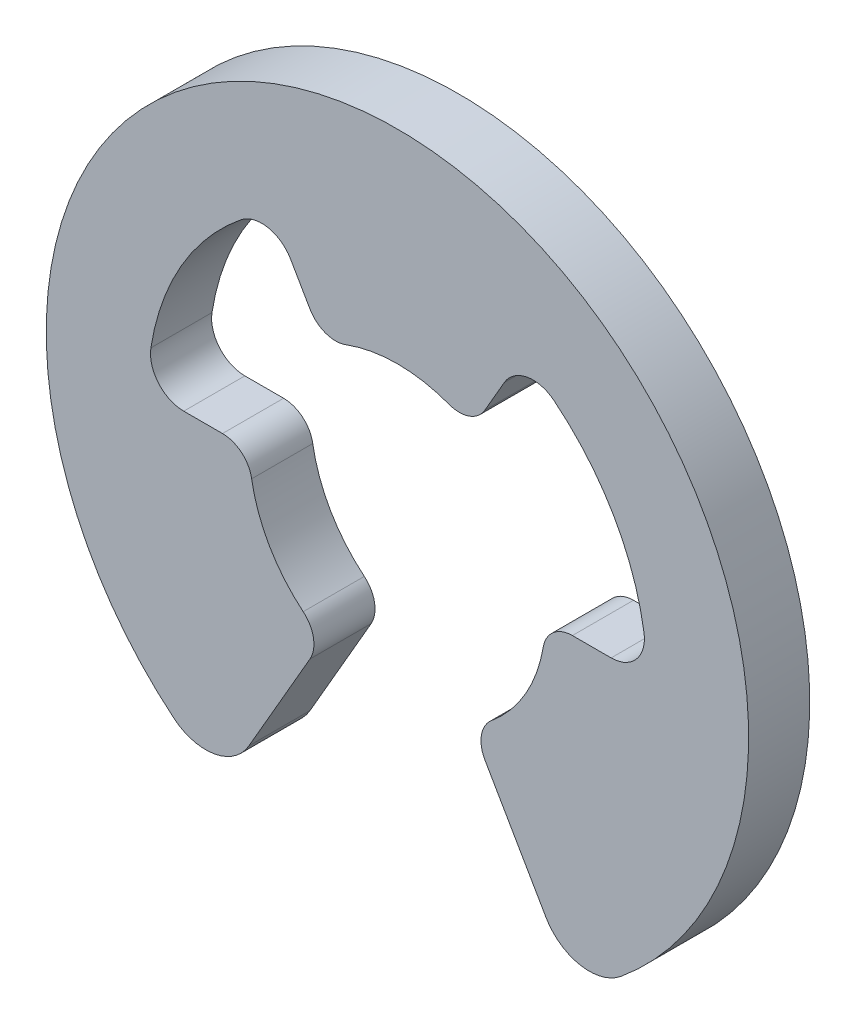
ISO-10303-21;
HEADER;
FILE_DESCRIPTION(('STEP AP214'),'2;1');
FILE_NAME('part.step','',(''),(''),'','','');
FILE_SCHEMA(('AUTOMOTIVE_DESIGN { 1 0 10303 214 1 1 1 1 }'));
ENDSEC;
DATA;
#1=APPLICATION_CONTEXT('core data for automotive mechanical design processes');
#2=APPLICATION_PROTOCOL_DEFINITION('international standard','automotive_design',2000,#1);
#3=PRODUCT_CONTEXT('',#1,'mechanical');
#4=PRODUCT('Part','Part','',(#3));
#5=PRODUCT_RELATED_PRODUCT_CATEGORY('part','',(#4));
#6=PRODUCT_DEFINITION_FORMATION('','',#4);
#7=PRODUCT_DEFINITION_CONTEXT('part definition',#1,'design');
#8=PRODUCT_DEFINITION('design','',#6,#7);
#9=PRODUCT_DEFINITION_SHAPE('','',#8);
#10=(LENGTH_UNIT() NAMED_UNIT(*) SI_UNIT(.MILLI.,.METRE.));
#11=(NAMED_UNIT(*) PLANE_ANGLE_UNIT() SI_UNIT($,.RADIAN.));
#12=(NAMED_UNIT(*) SI_UNIT($,.STERADIAN.) SOLID_ANGLE_UNIT());
#13=UNCERTAINTY_MEASURE_WITH_UNIT(LENGTH_MEASURE(1.E-05),#10,'distance_accuracy_value','');
#14=(GEOMETRIC_REPRESENTATION_CONTEXT(3) GLOBAL_UNCERTAINTY_ASSIGNED_CONTEXT((#13)) GLOBAL_UNIT_ASSIGNED_CONTEXT((#10,
#11,#12)) REPRESENTATION_CONTEXT('',''));
#15=CARTESIAN_POINT('',(0.,0.,0.));
#16=DIRECTION('',(0.,0.,1.));
#17=DIRECTION('',(1.,0.,0.));
#18=AXIS2_PLACEMENT_3D('',#15,#16,#17);
#19=CARTESIAN_POINT('',(1.5815751888149,-2.73936858301779,0.55245));
#20=DIRECTION('',(0.866025403784419,0.500000000000034,0.));
#21=DIRECTION('',(-0.500000000000034,0.866025403784419,0.));
#22=AXIS2_PLACEMENT_3D('',#19,#20,#21);
#23=PLANE('',#22);
#24=DIRECTION('',(0.500000000000034,-0.866025403784419,0.));
#25=VECTOR('',#24,1.);
#26=CARTESIAN_POINT('',(1.5815751888149,-2.73936858301779,-0.55245));
#27=LINE('',#26,#25);
#28=CARTESIAN_POINT('',(1.5815751888149,-2.73936858301779,-0.55245));
#29=VERTEX_POINT('',#28);
#30=CARTESIAN_POINT('',(2.6862076194889,-4.65264807663329,-0.55245));
#31=VERTEX_POINT('',#30);
#32=EDGE_CURVE('E11',#29,#31,#27,.T.);
#33=ORIENTED_EDGE('',*,*,#32,.T.);
#34=DIRECTION('',(0.,0.,-1.));
#35=VECTOR('',#34,1.);
#36=CARTESIAN_POINT('',(2.6862076194889,-4.65264807663329,0.55245));
#37=LINE('',#36,#35);
#38=CARTESIAN_POINT('',(2.6862076194889,-4.65264807663329,0.55245));
#39=VERTEX_POINT('',#38);
#40=EDGE_CURVE('E25',#39,#31,#37,.T.);
#41=ORIENTED_EDGE('',*,*,#40,.F.);
#42=DIRECTION('',(0.500000000000034,-0.866025403784419,0.));
#43=VECTOR('',#42,1.);
#44=CARTESIAN_POINT('',(1.5815751888149,-2.73936858301779,0.55245));
#45=LINE('',#44,#43);
#46=CARTESIAN_POINT('',(1.5815751888149,-2.73936858301779,0.55245));
#47=VERTEX_POINT('',#46);
#48=EDGE_CURVE('E352',#47,#39,#45,.T.);
#49=ORIENTED_EDGE('',*,*,#48,.F.);
#50=DIRECTION('',(0.,0.,-1.));
#51=VECTOR('',#50,1.);
#52=CARTESIAN_POINT('',(1.5815751888149,-2.73936858301779,0.55245));
#53=LINE('',#52,#51);
#54=EDGE_CURVE('E348',#47,#29,#53,.T.);
#55=ORIENTED_EDGE('',*,*,#54,.T.);
#56=EDGE_LOOP('',(#33,#41,#49,#55));
#57=FACE_BOUND('',#56,.T.);
#58=ADVANCED_FACE('F17',(#57),#23,.F.);
#59=CARTESIAN_POINT('',(2.04461299145625,-2.47203358301781,0.55245));
#60=DIRECTION('',(0.,0.,1.));
#61=DIRECTION('',(0.984186434408431,-0.177135717252107,0.));
#62=AXIS2_PLACEMENT_3D('',#59,#60,#61);
#63=CYLINDRICAL_SURFACE('',#62,0.53467);
#64=CARTESIAN_POINT('',(2.04461299145625,-2.47203358301781,-0.55245));
#65=DIRECTION('',(0.,0.,1.));
#66=DIRECTION('',(1.,0.,0.));
#67=AXIS2_PLACEMENT_3D('',#64,#65,#66);
#68=CIRCLE('',#67,0.53467);
#69=CARTESIAN_POINT('',(1.703844185326,-2.0600279645264,-0.55245));
#70=VERTEX_POINT('',#69);
#71=EDGE_CURVE('E343',#70,#29,#68,.T.);
#72=ORIENTED_EDGE('',*,*,#71,.T.);
#73=ORIENTED_EDGE('',*,*,#54,.F.);
#74=CARTESIAN_POINT('',(2.04461299145625,-2.47203358301781,0.55245));
#75=DIRECTION('',(0.,0.,1.));
#76=DIRECTION('',(1.,0.,0.));
#77=AXIS2_PLACEMENT_3D('',#74,#75,#76);
#78=CIRCLE('',#77,0.53467);
#79=CARTESIAN_POINT('',(1.703844185326,-2.0600279645264,0.55245));
#80=VERTEX_POINT('',#79);
#81=EDGE_CURVE('E338',#80,#47,#78,.T.);
#82=ORIENTED_EDGE('',*,*,#81,.F.);
#83=DIRECTION('',(0.,0.,-1.));
#84=VECTOR('',#83,1.);
#85=CARTESIAN_POINT('',(1.703844185326,-2.0600279645264,0.55245));
#86=LINE('',#85,#84);
#87=EDGE_CURVE('E334',#80,#70,#86,.T.);
#88=ORIENTED_EDGE('',*,*,#87,.T.);
#89=EDGE_LOOP('',(#72,#73,#82,#88));
#90=FACE_BOUND('',#89,.T.);
#91=ADVANCED_FACE('F365',(#90),#63,.T.);
#92=CARTESIAN_POINT('',(-3.68195057776077E-13,2.1543097167287E-13,0.55245));
#93=DIRECTION('',(0.,0.,1.));
#94=DIRECTION('',(-0.866025405955022,0.499999996240439,0.));
#95=AXIS2_PLACEMENT_3D('',#92,#93,#94);
#96=CYLINDRICAL_SURFACE('',#95,2.67335);
#97=DIRECTION('',(0.,0.,-1.));
#98=VECTOR('',#97,1.);
#99=CARTESIAN_POINT('',(2.63595864631771,-0.44555834343324,0.55245));
#100=LINE('',#99,#98);
#101=CARTESIAN_POINT('',(2.63595864631771,-0.44555834343324,0.55245));
#102=VERTEX_POINT('',#101);
#103=CARTESIAN_POINT('',(2.63595864631771,-0.44555834343324,-0.55245));
#104=VERTEX_POINT('',#103);
#105=EDGE_CURVE('E330',#102,#104,#100,.T.);
#106=ORIENTED_EDGE('',*,*,#105,.T.);
#107=CARTESIAN_POINT('',(-3.68195057776077E-13,2.1543097167287E-13,-0.55245));
#108=DIRECTION('',(0.,0.,1.));
#109=DIRECTION('',(1.,0.,0.));
#110=AXIS2_PLACEMENT_3D('',#107,#108,#109);
#111=CIRCLE('',#110,2.67335);
#112=EDGE_CURVE('E325',#70,#104,#111,.T.);
#113=ORIENTED_EDGE('',*,*,#112,.F.);
#114=ORIENTED_EDGE('',*,*,#87,.F.);
#115=CARTESIAN_POINT('',(-3.68195057776077E-13,2.1543097167287E-13,0.55245));
#116=DIRECTION('',(0.,0.,1.));
#117=DIRECTION('',(1.,0.,0.));
#118=AXIS2_PLACEMENT_3D('',#115,#116,#117);
#119=CIRCLE('',#118,2.67335);
#120=EDGE_CURVE('E321',#80,#102,#119,.T.);
#121=ORIENTED_EDGE('',*,*,#120,.T.);
#122=EDGE_LOOP('',(#106,#113,#114,#121));
#123=FACE_BOUND('',#122,.T.);
#124=ADVANCED_FACE('F372',(#123),#96,.F.);
#125=CARTESIAN_POINT('',(3.46765265221273,-4.20148057663334,0.55245));
#126=DIRECTION('',(0.,0.,1.));
#127=DIRECTION('',(1.,0.,0.));
#128=AXIS2_PLACEMENT_3D('',#125,#126,#127);
#129=PLANE('',#128);
#130=CARTESIAN_POINT('',(3.46765265221273,-4.20148057663334,0.55245));
#131=DIRECTION('',(0.,0.,1.));
#132=DIRECTION('',(1.,0.,0.));
#133=AXIS2_PLACEMENT_3D('',#130,#131,#132);
#134=CIRCLE('',#133,0.902335);
#135=CARTESIAN_POINT('',(4.04202433636569,-4.8974012766188,0.55245));
#136=VERTEX_POINT('',#135);
#137=EDGE_CURVE('E317',#39,#136,#134,.T.);
#138=ORIENTED_EDGE('',*,*,#137,.T.);
#139=CARTESIAN_POINT('',(0.,0.,0.55245));
#140=DIRECTION('',(0.,0.,1.));
#141=DIRECTION('',(1.,0.,0.));
#142=AXIS2_PLACEMENT_3D('',#139,#140,#141);
#143=CIRCLE('',#142,6.35);
#144=CARTESIAN_POINT('',(-4.04202430611109,-4.89740130158921,0.55245));
#145=VERTEX_POINT('',#144);
#146=EDGE_CURVE('E189',#136,#145,#143,.T.);
#147=ORIENTED_EDGE('',*,*,#146,.T.);
#148=CARTESIAN_POINT('',(-3.46765265221278,-4.20148057663329,0.55245));
#149=DIRECTION('',(0.,0.,1.));
#150=DIRECTION('',(1.,0.,0.));
#151=AXIS2_PLACEMENT_3D('',#148,#149,#150);
#152=CIRCLE('',#151,0.902335);
#153=CARTESIAN_POINT('',(-2.6862076194889,-4.65264807663329,0.55245));
#154=VERTEX_POINT('',#153);
#155=EDGE_CURVE('E310',#145,#154,#152,.T.);
#156=ORIENTED_EDGE('',*,*,#155,.T.);
#157=DIRECTION('',(0.500000000000034,0.866025403784419,0.));
#158=VECTOR('',#157,1.);
#159=CARTESIAN_POINT('',(-2.6862076194889,-4.65264807663329,0.55245));
#160=LINE('',#159,#158);
#161=CARTESIAN_POINT('',(-1.5815751888149,-2.73936858301779,0.55245));
#162=VERTEX_POINT('',#161);
#163=EDGE_CURVE('E306',#154,#162,#160,.T.);
#164=ORIENTED_EDGE('',*,*,#163,.T.);
#165=CARTESIAN_POINT('',(-2.04461299145624,-2.47203358301781,0.55245));
#166=DIRECTION('',(0.,0.,1.));
#167=DIRECTION('',(1.,0.,0.));
#168=AXIS2_PLACEMENT_3D('',#165,#166,#167);
#169=CIRCLE('',#168,0.53467);
#170=CARTESIAN_POINT('',(-1.7038441516538,-2.0600279923766,0.55245));
#171=VERTEX_POINT('',#170);
#172=EDGE_CURVE('E302',#162,#171,#169,.T.);
#173=ORIENTED_EDGE('',*,*,#172,.T.);
#174=CARTESIAN_POINT('',(2.78856798763273E-13,1.27285335049798E-13,0.55245));
#175=DIRECTION('',(0.,0.,1.));
#176=DIRECTION('',(1.,0.,0.));
#177=AXIS2_PLACEMENT_3D('',#174,#175,#176);
#178=CIRCLE('',#177,2.67335);
#179=CARTESIAN_POINT('',(-2.63595864244921,-0.445558366319478,0.55245));
#180=VERTEX_POINT('',#179);
#181=EDGE_CURVE('E297',#180,#171,#178,.T.);
#182=ORIENTED_EDGE('',*,*,#181,.F.);
#183=CARTESIAN_POINT('',(-3.16315037762992,-0.534670000000076,0.55245));
#184=DIRECTION('',(0.,0.,1.));
#185=DIRECTION('',(1.,0.,0.));
#186=AXIS2_PLACEMENT_3D('',#183,#184,#185);
#187=CIRCLE('',#186,0.53467);
#188=CARTESIAN_POINT('',(-3.1631503776299,0.,0.55245));
#189=VERTEX_POINT('',#188);
#190=EDGE_CURVE('E293',#180,#189,#187,.T.);
#191=ORIENTED_EDGE('',*,*,#190,.T.);
#192=DIRECTION('',(-1.,0.,0.));
#193=VECTOR('',#192,1.);
#194=CARTESIAN_POINT('',(-3.1631503776299,0.,0.55245));
#195=LINE('',#194,#193);
#196=CARTESIAN_POINT('',(-3.86356764628989,0.,0.55245));
#197=VERTEX_POINT('',#196);
#198=EDGE_CURVE('E289',#189,#197,#195,.T.);
#199=ORIENTED_EDGE('',*,*,#198,.T.);
#200=CARTESIAN_POINT('',(-3.86356764628999,0.601556666666607,0.55245));
#201=DIRECTION('',(0.,0.,1.));
#202=DIRECTION('',(1.,0.,0.));
#203=AXIS2_PLACEMENT_3D('',#200,#201,#202);
#204=CIRCLE('',#203,0.60155666582);
#205=CARTESIAN_POINT('',(-4.45796267102469,0.694103831840271,0.55245));
#206=VERTEX_POINT('',#205);
#207=EDGE_CURVE('E284',#206,#197,#204,.T.);
#208=ORIENTED_EDGE('',*,*,#207,.F.);
#209=CARTESIAN_POINT('',(0.,0.,0.55245));
#210=DIRECTION('',(0.,0.,1.));
#211=DIRECTION('',(1.,0.,0.));
#212=AXIS2_PLACEMENT_3D('',#209,#210,#211);
#213=CIRCLE('',#212,4.511675);
#214=CARTESIAN_POINT('',(-2.83009289803179,3.51365699722321,0.55245));
#215=VERTEX_POINT('',#214);
#216=EDGE_CURVE('E279',#215,#206,#213,.T.);
#217=ORIENTED_EDGE('',*,*,#216,.F.);
#218=CARTESIAN_POINT('',(-2.45274717829428,3.04516939759327,0.55245));
#219=DIRECTION('',(0.,0.,1.));
#220=DIRECTION('',(1.,0.,0.));
#221=AXIS2_PLACEMENT_3D('',#218,#219,#220);
#222=CIRCLE('',#221,0.60155666582);
#223=CARTESIAN_POINT('',(-1.931783823145,3.34594773092669,0.55245));
#224=VERTEX_POINT('',#223);
#225=EDGE_CURVE('E274',#224,#215,#222,.T.);
#226=ORIENTED_EDGE('',*,*,#225,.F.);
#227=DIRECTION('',(0.500000000000089,-0.866025403784387,0.));
#228=VECTOR('',#227,1.);
#229=CARTESIAN_POINT('',(-1.931783823145,3.34594773092669,0.55245));
#230=LINE('',#229,#228);
#231=CARTESIAN_POINT('',(-1.5815751888149,2.73936858301779,0.55245));
#232=VERTEX_POINT('',#231);
#233=EDGE_CURVE('E270',#224,#232,#230,.T.);
#234=ORIENTED_EDGE('',*,*,#233,.T.);
#235=CARTESIAN_POINT('',(-1.1185373861735,3.00670358301774,0.55245));
#236=DIRECTION('',(0.,0.,1.));
#237=DIRECTION('',(1.,0.,0.));
#238=AXIS2_PLACEMENT_3D('',#235,#236,#237);
#239=CIRCLE('',#238,0.53467);
#240=CARTESIAN_POINT('',(-0.932114488477919,2.5055863191815,0.55245));
#241=VERTEX_POINT('',#240);
#242=EDGE_CURVE('E266',#232,#241,#239,.T.);
#243=ORIENTED_EDGE('',*,*,#242,.T.);
#244=CARTESIAN_POINT('',(0.,1.1145598333151E-13,0.55245));
#245=DIRECTION('',(0.,0.,1.));
#246=DIRECTION('',(1.,0.,0.));
#247=AXIS2_PLACEMENT_3D('',#244,#245,#246);
#248=CIRCLE('',#247,2.67335);
#249=CARTESIAN_POINT('',(0.93211445712324,2.5055863308459,0.55245));
#250=VERTEX_POINT('',#249);
#251=EDGE_CURVE('E261',#250,#241,#248,.T.);
#252=ORIENTED_EDGE('',*,*,#251,.F.);
#253=CARTESIAN_POINT('',(1.11853738617351,3.00670358301774,0.55245));
#254=DIRECTION('',(0.,0.,1.));
#255=DIRECTION('',(1.,0.,0.));
#256=AXIS2_PLACEMENT_3D('',#253,#254,#255);
#257=CIRCLE('',#256,0.53467);
#258=CARTESIAN_POINT('',(1.5815751888149,2.73936858301779,0.55245));
#259=VERTEX_POINT('',#258);
#260=EDGE_CURVE('E257',#250,#259,#257,.T.);
#261=ORIENTED_EDGE('',*,*,#260,.T.);
#262=DIRECTION('',(0.500000000000089,0.866025403784387,0.));
#263=VECTOR('',#262,1.);
#264=CARTESIAN_POINT('',(1.5815751888149,2.73936858301779,0.55245));
#265=LINE('',#264,#263);
#266=CARTESIAN_POINT('',(1.931783823145,3.34594773092669,0.55245));
#267=VERTEX_POINT('',#266);
#268=EDGE_CURVE('E253',#259,#267,#265,.T.);
#269=ORIENTED_EDGE('',*,*,#268,.T.);
#270=CARTESIAN_POINT('',(2.45274717829425,3.04516939759332,0.55245));
#271=DIRECTION('',(0.,0.,1.));
#272=DIRECTION('',(1.,0.,0.));
#273=AXIS2_PLACEMENT_3D('',#270,#271,#272);
#274=CIRCLE('',#273,0.60155666582);
#275=CARTESIAN_POINT('',(2.83009293124389,3.51365697047231,0.55245));
#276=VERTEX_POINT('',#275);
#277=EDGE_CURVE('E248',#276,#267,#274,.T.);
#278=ORIENTED_EDGE('',*,*,#277,.F.);
#279=CARTESIAN_POINT('',(1.30971622436249E-13,0.,0.55245));
#280=DIRECTION('',(0.,0.,1.));
#281=DIRECTION('',(1.,0.,0.));
#282=AXIS2_PLACEMENT_3D('',#279,#280,#281);
#283=CIRCLE('',#282,4.511675);
#284=CARTESIAN_POINT('',(4.4579626687961,0.694103846153849,0.55245));
#285=VERTEX_POINT('',#284);
#286=EDGE_CURVE('E243',#285,#276,#283,.T.);
#287=ORIENTED_EDGE('',*,*,#286,.F.);
#288=CARTESIAN_POINT('',(3.86356764628999,0.601556666666638,0.55245));
#289=DIRECTION('',(0.,0.,1.));
#290=DIRECTION('',(1.,0.,0.));
#291=AXIS2_PLACEMENT_3D('',#288,#289,#290);
#292=CIRCLE('',#291,0.60155666582);
#293=CARTESIAN_POINT('',(3.86356764628989,0.,0.55245));
#294=VERTEX_POINT('',#293);
#295=EDGE_CURVE('E238',#294,#285,#292,.T.);
#296=ORIENTED_EDGE('',*,*,#295,.F.);
#297=DIRECTION('',(-1.,0.,0.));
#298=VECTOR('',#297,1.);
#299=CARTESIAN_POINT('',(3.86356764628989,0.,0.55245));
#300=LINE('',#299,#298);
#301=CARTESIAN_POINT('',(3.1631503776299,0.,0.55245));
#302=VERTEX_POINT('',#301);
#303=EDGE_CURVE('E234',#294,#302,#300,.T.);
#304=ORIENTED_EDGE('',*,*,#303,.T.);
#305=CARTESIAN_POINT('',(3.1631503776299,-0.534670000000036,0.55245));
#306=DIRECTION('',(0.,0.,1.));
#307=DIRECTION('',(1.,0.,0.));
#308=AXIS2_PLACEMENT_3D('',#305,#306,#307);
#309=CIRCLE('',#308,0.53467);
#310=EDGE_CURVE('E229',#302,#102,#309,.T.);
#311=ORIENTED_EDGE('',*,*,#310,.T.);
#312=ORIENTED_EDGE('',*,*,#120,.F.);
#313=ORIENTED_EDGE('',*,*,#81,.T.);
#314=ORIENTED_EDGE('',*,*,#48,.T.);
#315=EDGE_LOOP('',(#138,#147,#156,#164,#173,#182,#191,#199,#208,#217,#226,#234,#243,#252,#261,
#269,#278,#287,#296,#304,#311,#312,#313,#314));
#316=FACE_BOUND('',#315,.T.);
#317=ADVANCED_FACE('F361',(#316),#129,.T.);
#318=CARTESIAN_POINT('',(3.1631503776299,-0.534670000000036,0.55245));
#319=DIRECTION('',(0.,0.,1.));
#320=DIRECTION('',(0.645497231683939,-0.763762609642794,0.));
#321=AXIS2_PLACEMENT_3D('',#318,#319,#320);
#322=CYLINDRICAL_SURFACE('',#321,0.53467);
#323=CARTESIAN_POINT('',(3.1631503776299,-0.534670000000036,-0.55245));
#324=DIRECTION('',(0.,0.,1.));
#325=DIRECTION('',(1.,0.,0.));
#326=AXIS2_PLACEMENT_3D('',#323,#324,#325);
#327=CIRCLE('',#326,0.53467);
#328=CARTESIAN_POINT('',(3.1631503776299,0.,-0.55245));
#329=VERTEX_POINT('',#328);
#330=EDGE_CURVE('E224',#329,#104,#327,.T.);
#331=ORIENTED_EDGE('',*,*,#330,.T.);
#332=ORIENTED_EDGE('',*,*,#105,.F.);
#333=ORIENTED_EDGE('',*,*,#310,.F.);
#334=DIRECTION('',(0.,0.,-1.));
#335=VECTOR('',#334,1.);
#336=CARTESIAN_POINT('',(3.1631503776299,0.,0.55245));
#337=LINE('',#336,#335);
#338=EDGE_CURVE('E220',#302,#329,#337,.T.);
#339=ORIENTED_EDGE('',*,*,#338,.T.);
#340=EDGE_LOOP('',(#331,#332,#333,#339));
#341=FACE_BOUND('',#340,.T.);
#342=ADVANCED_FACE('F376',(#341),#322,.T.);
#343=CARTESIAN_POINT('',(3.86356764628989,0.,0.55245));
#344=DIRECTION('',(0.,-1.,0.));
#345=DIRECTION('',(0.,0.,-1.));
#346=AXIS2_PLACEMENT_3D('',#343,#344,#345);
#347=PLANE('',#346);
#348=DIRECTION('',(-1.,0.,0.));
#349=VECTOR('',#348,1.);
#350=CARTESIAN_POINT('',(3.86356764628989,0.,-0.55245));
#351=LINE('',#350,#349);
#352=CARTESIAN_POINT('',(3.86356764628989,0.,-0.55245));
#353=VERTEX_POINT('',#352);
#354=EDGE_CURVE('E215',#353,#329,#351,.T.);
#355=ORIENTED_EDGE('',*,*,#354,.T.);
#356=ORIENTED_EDGE('',*,*,#338,.F.);
#357=ORIENTED_EDGE('',*,*,#303,.F.);
#358=DIRECTION('',(0.,0.,-1.));
#359=VECTOR('',#358,1.);
#360=CARTESIAN_POINT('',(3.86356764628989,0.,0.55245));
#361=LINE('',#360,#359);
#362=EDGE_CURVE('E211',#294,#353,#361,.T.);
#363=ORIENTED_EDGE('',*,*,#362,.T.);
#364=EDGE_LOOP('',(#355,#356,#357,#363));
#365=FACE_BOUND('',#364,.T.);
#366=ADVANCED_FACE('F380',(#365),#347,.F.);
#367=CARTESIAN_POINT('',(3.86356764628999,0.601556666666638,0.55245));
#368=DIRECTION('',(0.,0.,1.));
#369=DIRECTION('',(-0.759554525312715,0.650443635588032,0.));
#370=AXIS2_PLACEMENT_3D('',#367,#368,#369);
#371=CYLINDRICAL_SURFACE('',#370,0.60155666582);
#372=DIRECTION('',(0.,0.,-1.));
#373=VECTOR('',#372,1.);
#374=CARTESIAN_POINT('',(4.4579626687961,0.694103846153849,0.55245));
#375=LINE('',#374,#373);
#376=CARTESIAN_POINT('',(4.4579626687961,0.694103846153849,-0.55245));
#377=VERTEX_POINT('',#376);
#378=EDGE_CURVE('E199',#285,#377,#375,.T.);
#379=ORIENTED_EDGE('',*,*,#378,.T.);
#380=CARTESIAN_POINT('',(3.86356764628999,0.601556666666638,-0.55245));
#381=DIRECTION('',(0.,0.,1.));
#382=DIRECTION('',(1.,0.,0.));
#383=AXIS2_PLACEMENT_3D('',#380,#381,#382);
#384=CIRCLE('',#383,0.60155666582);
#385=EDGE_CURVE('E195',#353,#377,#384,.T.);
#386=ORIENTED_EDGE('',*,*,#385,.F.);
#387=ORIENTED_EDGE('',*,*,#362,.F.);
#388=ORIENTED_EDGE('',*,*,#295,.T.);
#389=EDGE_LOOP('',(#379,#386,#387,#388));
#390=FACE_BOUND('',#389,.T.);
#391=ADVANCED_FACE('F619',(#390),#371,.F.);
#392=CARTESIAN_POINT('',(3.46765265221273,-4.20148057663334,-0.55245));
#393=DIRECTION('',(0.,0.,1.));
#394=DIRECTION('',(1.,0.,0.));
#395=AXIS2_PLACEMENT_3D('',#392,#393,#394);
#396=PLANE('',#395);
#397=CARTESIAN_POINT('',(3.46765265221273,-4.20148057663334,-0.55245));
#398=DIRECTION('',(0.,0.,1.));
#399=DIRECTION('',(1.,0.,0.));
#400=AXIS2_PLACEMENT_3D('',#397,#398,#399);
#401=CIRCLE('',#400,0.902335);
#402=CARTESIAN_POINT('',(4.04202433636569,-4.8974012766188,-0.55245));
#403=VERTEX_POINT('',#402);
#404=EDGE_CURVE('E177',#31,#403,#401,.T.);
#405=ORIENTED_EDGE('',*,*,#404,.F.);
#406=ORIENTED_EDGE('',*,*,#32,.F.);
#407=ORIENTED_EDGE('',*,*,#71,.F.);
#408=ORIENTED_EDGE('',*,*,#112,.T.);
#409=ORIENTED_EDGE('',*,*,#330,.F.);
#410=ORIENTED_EDGE('',*,*,#354,.F.);
#411=ORIENTED_EDGE('',*,*,#385,.T.);
#412=CARTESIAN_POINT('',(1.30971622436249E-13,0.,-0.55245));
#413=DIRECTION('',(0.,0.,1.));
#414=DIRECTION('',(1.,0.,0.));
#415=AXIS2_PLACEMENT_3D('',#412,#413,#414);
#416=CIRCLE('',#415,4.511675);
#417=CARTESIAN_POINT('',(2.83009293124389,3.51365697047231,-0.55245));
#418=VERTEX_POINT('',#417);
#419=EDGE_CURVE('E196',#377,#418,#416,.T.);
#420=ORIENTED_EDGE('',*,*,#419,.T.);
#421=CARTESIAN_POINT('',(2.45274717829425,3.04516939759332,-0.55245));
#422=DIRECTION('',(0.,0.,1.));
#423=DIRECTION('',(1.,0.,0.));
#424=AXIS2_PLACEMENT_3D('',#421,#422,#423);
#425=CIRCLE('',#424,0.60155666582);
#426=CARTESIAN_POINT('',(1.931783823145,3.34594773092669,-0.55245));
#427=VERTEX_POINT('',#426);
#428=EDGE_CURVE('E201',#418,#427,#425,.T.);
#429=ORIENTED_EDGE('',*,*,#428,.T.);
#430=DIRECTION('',(0.500000000000089,0.866025403784387,0.));
#431=VECTOR('',#430,1.);
#432=CARTESIAN_POINT('',(1.5815751888149,2.73936858301779,-0.55245));
#433=LINE('',#432,#431);
#434=CARTESIAN_POINT('',(1.5815751888149,2.73936858301779,-0.55245));
#435=VERTEX_POINT('',#434);
#436=EDGE_CURVE('E529',#435,#427,#433,.T.);
#437=ORIENTED_EDGE('',*,*,#436,.F.);
#438=CARTESIAN_POINT('',(1.11853738617351,3.00670358301774,-0.55245));
#439=DIRECTION('',(0.,0.,1.));
#440=DIRECTION('',(1.,0.,0.));
#441=AXIS2_PLACEMENT_3D('',#438,#439,#440);
#442=CIRCLE('',#441,0.53467);
#443=CARTESIAN_POINT('',(0.93211445712324,2.5055863308459,-0.55245));
#444=VERTEX_POINT('',#443);
#445=EDGE_CURVE('E524',#444,#435,#442,.T.);
#446=ORIENTED_EDGE('',*,*,#445,.F.);
#447=CARTESIAN_POINT('',(0.,1.1145598333151E-13,-0.55245));
#448=DIRECTION('',(0.,0.,1.));
#449=DIRECTION('',(1.,0.,0.));
#450=AXIS2_PLACEMENT_3D('',#447,#448,#449);
#451=CIRCLE('',#450,2.67335);
#452=CARTESIAN_POINT('',(-0.932114488477919,2.5055863191815,-0.55245));
#453=VERTEX_POINT('',#452);
#454=EDGE_CURVE('E520',#444,#453,#451,.T.);
#455=ORIENTED_EDGE('',*,*,#454,.T.);
#456=CARTESIAN_POINT('',(-1.1185373861735,3.00670358301774,-0.55245));
#457=DIRECTION('',(0.,0.,1.));
#458=DIRECTION('',(1.,0.,0.));
#459=AXIS2_PLACEMENT_3D('',#456,#457,#458);
#460=CIRCLE('',#459,0.53467);
#461=CARTESIAN_POINT('',(-1.5815751888149,2.73936858301779,-0.55245));
#462=VERTEX_POINT('',#461);
#463=EDGE_CURVE('E515',#462,#453,#460,.T.);
#464=ORIENTED_EDGE('',*,*,#463,.F.);
#465=DIRECTION('',(0.500000000000089,-0.866025403784387,0.));
#466=VECTOR('',#465,1.);
#467=CARTESIAN_POINT('',(-1.931783823145,3.34594773092669,-0.55245));
#468=LINE('',#467,#466);
#469=CARTESIAN_POINT('',(-1.931783823145,3.34594773092669,-0.55245));
#470=VERTEX_POINT('',#469);
#471=EDGE_CURVE('E510',#470,#462,#468,.T.);
#472=ORIENTED_EDGE('',*,*,#471,.F.);
#473=CARTESIAN_POINT('',(-2.45274717829428,3.04516939759327,-0.55245));
#474=DIRECTION('',(0.,0.,1.));
#475=DIRECTION('',(1.,0.,0.));
#476=AXIS2_PLACEMENT_3D('',#473,#474,#475);
#477=CIRCLE('',#476,0.60155666582);
#478=CARTESIAN_POINT('',(-2.83009289803179,3.51365699722321,-0.55245));
#479=VERTEX_POINT('',#478);
#480=EDGE_CURVE('E506',#470,#479,#477,.T.);
#481=ORIENTED_EDGE('',*,*,#480,.T.);
#482=CARTESIAN_POINT('',(0.,0.,-0.55245));
#483=DIRECTION('',(0.,0.,1.));
#484=DIRECTION('',(1.,0.,0.));
#485=AXIS2_PLACEMENT_3D('',#482,#483,#484);
#486=CIRCLE('',#485,4.511675);
#487=CARTESIAN_POINT('',(-4.45796267102469,0.694103831840271,-0.55245));
#488=VERTEX_POINT('',#487);
#489=EDGE_CURVE('E502',#479,#488,#486,.T.);
#490=ORIENTED_EDGE('',*,*,#489,.T.);
#491=CARTESIAN_POINT('',(-3.86356764628999,0.601556666666607,-0.55245));
#492=DIRECTION('',(0.,0.,1.));
#493=DIRECTION('',(1.,0.,0.));
#494=AXIS2_PLACEMENT_3D('',#491,#492,#493);
#495=CIRCLE('',#494,0.60155666582);
#496=CARTESIAN_POINT('',(-3.86356764628989,0.,-0.55245));
#497=VERTEX_POINT('',#496);
#498=EDGE_CURVE('E498',#488,#497,#495,.T.);
#499=ORIENTED_EDGE('',*,*,#498,.T.);
#500=DIRECTION('',(-1.,0.,0.));
#501=VECTOR('',#500,1.);
#502=CARTESIAN_POINT('',(-3.1631503776299,0.,-0.55245));
#503=LINE('',#502,#501);
#504=CARTESIAN_POINT('',(-3.1631503776299,0.,-0.55245));
#505=VERTEX_POINT('',#504);
#506=EDGE_CURVE('E493',#505,#497,#503,.T.);
#507=ORIENTED_EDGE('',*,*,#506,.F.);
#508=CARTESIAN_POINT('',(-3.16315037762992,-0.534670000000076,-0.55245));
#509=DIRECTION('',(0.,0.,1.));
#510=DIRECTION('',(1.,0.,0.));
#511=AXIS2_PLACEMENT_3D('',#508,#509,#510);
#512=CIRCLE('',#511,0.53467);
#513=CARTESIAN_POINT('',(-2.63595864244921,-0.445558366319478,-0.55245));
#514=VERTEX_POINT('',#513);
#515=EDGE_CURVE('E488',#514,#505,#512,.T.);
#516=ORIENTED_EDGE('',*,*,#515,.F.);
#517=CARTESIAN_POINT('',(2.78856798763273E-13,1.27285335049798E-13,-0.55245));
#518=DIRECTION('',(0.,0.,1.));
#519=DIRECTION('',(1.,0.,0.));
#520=AXIS2_PLACEMENT_3D('',#517,#518,#519);
#521=CIRCLE('',#520,2.67335);
#522=CARTESIAN_POINT('',(-1.7038441516538,-2.0600279923766,-0.55245));
#523=VERTEX_POINT('',#522);
#524=EDGE_CURVE('E484',#514,#523,#521,.T.);
#525=ORIENTED_EDGE('',*,*,#524,.T.);
#526=CARTESIAN_POINT('',(-2.04461299145624,-2.47203358301781,-0.55245));
#527=DIRECTION('',(0.,0.,1.));
#528=DIRECTION('',(1.,0.,0.));
#529=AXIS2_PLACEMENT_3D('',#526,#527,#528);
#530=CIRCLE('',#529,0.53467);
#531=CARTESIAN_POINT('',(-1.5815751888149,-2.73936858301779,-0.55245));
#532=VERTEX_POINT('',#531);
#533=EDGE_CURVE('E479',#532,#523,#530,.T.);
#534=ORIENTED_EDGE('',*,*,#533,.F.);
#535=DIRECTION('',(0.500000000000034,0.866025403784419,0.));
#536=VECTOR('',#535,1.);
#537=CARTESIAN_POINT('',(-2.6862076194889,-4.65264807663329,-0.55245));
#538=LINE('',#537,#536);
#539=CARTESIAN_POINT('',(-2.6862076194889,-4.65264807663329,-0.55245));
#540=VERTEX_POINT('',#539);
#541=EDGE_CURVE('E474',#540,#532,#538,.T.);
#542=ORIENTED_EDGE('',*,*,#541,.F.);
#543=CARTESIAN_POINT('',(-3.46765265221278,-4.20148057663329,-0.55245));
#544=DIRECTION('',(0.,0.,1.));
#545=DIRECTION('',(1.,0.,0.));
#546=AXIS2_PLACEMENT_3D('',#543,#544,#545);
#547=CIRCLE('',#546,0.902335);
#548=CARTESIAN_POINT('',(-4.04202430611109,-4.89740130158921,-0.55245));
#549=VERTEX_POINT('',#548);
#550=EDGE_CURVE('E179',#549,#540,#547,.T.);
#551=ORIENTED_EDGE('',*,*,#550,.F.);
#552=CARTESIAN_POINT('',(0.,0.,-0.55245));
#553=DIRECTION('',(0.,0.,1.));
#554=DIRECTION('',(1.,0.,0.));
#555=AXIS2_PLACEMENT_3D('',#552,#553,#554);
#556=CIRCLE('',#555,6.35);
#557=EDGE_CURVE('E173',#403,#549,#556,.T.);
#558=ORIENTED_EDGE('',*,*,#557,.F.);
#559=EDGE_LOOP('',(#405,#406,#407,#408,#409,#410,#411,#420,#429,#437,#446,#455,#464,#472,#481,
#490,#499,#507,#516,#525,#534,#542,#551,#558));
#560=FACE_BOUND('',#559,.T.);
#561=ADVANCED_FACE('F175',(#560),#396,.F.);
#562=CARTESIAN_POINT('',(0.,0.,0.55245));
#563=DIRECTION('',(0.,0.,1.));
#564=DIRECTION('',(3.08884889315887E-09,-1.,0.));
#565=AXIS2_PLACEMENT_3D('',#562,#563,#564);
#566=CYLINDRICAL_SURFACE('',#565,6.35);
#567=ORIENTED_EDGE('',*,*,#557,.T.);
#568=DIRECTION('',(0.,0.,-1.));
#569=VECTOR('',#568,1.);
#570=CARTESIAN_POINT('',(-4.04202430611109,-4.89740130158921,0.55245));
#571=LINE('',#570,#569);
#572=EDGE_CURVE('E183',#145,#549,#571,.T.);
#573=ORIENTED_EDGE('',*,*,#572,.F.);
#574=ORIENTED_EDGE('',*,*,#146,.F.);
#575=DIRECTION('',(0.,0.,-1.));
#576=VECTOR('',#575,1.);
#577=CARTESIAN_POINT('',(4.04202433636569,-4.8974012766188,0.55245));
#578=LINE('',#577,#576);
#579=EDGE_CURVE('E187',#136,#403,#578,.T.);
#580=ORIENTED_EDGE('',*,*,#579,.T.);
#581=EDGE_LOOP('',(#567,#573,#574,#580));
#582=FACE_BOUND('',#581,.T.);
#583=ADVANCED_FACE('F188',(#582),#566,.T.);
#584=CARTESIAN_POINT('',(3.46765265221273,-4.20148057663334,0.55245));
#585=DIRECTION('',(0.,0.,1.));
#586=DIRECTION('',(0.177649464824321,0.984093830713125,0.));
#587=AXIS2_PLACEMENT_3D('',#584,#585,#586);
#588=CYLINDRICAL_SURFACE('',#587,0.902335);
#589=ORIENTED_EDGE('',*,*,#404,.T.);
#590=ORIENTED_EDGE('',*,*,#579,.F.);
#591=ORIENTED_EDGE('',*,*,#137,.F.);
#592=ORIENTED_EDGE('',*,*,#40,.T.);
#593=EDGE_LOOP('',(#589,#590,#591,#592));
#594=FACE_BOUND('',#593,.T.);
#595=ADVANCED_FACE('F194',(#594),#588,.T.);
#596=CARTESIAN_POINT('',(-3.46765265221278,-4.20148057663329,0.55245));
#597=DIRECTION('',(0.,0.,1.));
#598=DIRECTION('',(-0.17764948621572,0.984093826851531,0.));
#599=AXIS2_PLACEMENT_3D('',#596,#597,#598);
#600=CYLINDRICAL_SURFACE('',#599,0.902335);
#601=ORIENTED_EDGE('',*,*,#550,.T.);
#602=DIRECTION('',(0.,0.,-1.));
#603=VECTOR('',#602,1.);
#604=CARTESIAN_POINT('',(-2.6862076194889,-4.65264807663329,0.55245));
#605=LINE('',#604,#603);
#606=EDGE_CURVE('E192',#154,#540,#605,.T.);
#607=ORIENTED_EDGE('',*,*,#606,.F.);
#608=ORIENTED_EDGE('',*,*,#155,.F.);
#609=ORIENTED_EDGE('',*,*,#572,.T.);
#610=EDGE_LOOP('',(#601,#607,#608,#609));
#611=FACE_BOUND('',#610,.T.);
#612=ADVANCED_FACE('F594',(#611),#600,.T.);
#613=CARTESIAN_POINT('',(-2.6862076194889,-4.65264807663329,0.55245));
#614=DIRECTION('',(-0.866025403784419,0.500000000000034,0.));
#615=DIRECTION('',(-0.500000000000034,-0.866025403784419,0.));
#616=AXIS2_PLACEMENT_3D('',#613,#614,#615);
#617=PLANE('',#616);
#618=ORIENTED_EDGE('',*,*,#541,.T.);
#619=DIRECTION('',(0.,0.,-1.));
#620=VECTOR('',#619,1.);
#621=CARTESIAN_POINT('',(-1.5815751888149,-2.73936858301779,0.55245));
#622=LINE('',#621,#620);
#623=EDGE_CURVE('E455',#162,#532,#622,.T.);
#624=ORIENTED_EDGE('',*,*,#623,.F.);
#625=ORIENTED_EDGE('',*,*,#163,.F.);
#626=ORIENTED_EDGE('',*,*,#606,.T.);
#627=EDGE_LOOP('',(#618,#624,#625,#626));
#628=FACE_BOUND('',#627,.T.);
#629=ADVANCED_FACE('F589',(#628),#617,.F.);
#630=CARTESIAN_POINT('',(-2.04461299145624,-2.47203358301781,0.55245));
#631=DIRECTION('',(0.,0.,1.));
#632=DIRECTION('',(-0.984186441646864,-0.17713567703454,0.));
#633=AXIS2_PLACEMENT_3D('',#630,#631,#632);
#634=CYLINDRICAL_SURFACE('',#633,0.53467);
#635=ORIENTED_EDGE('',*,*,#533,.T.);
#636=DIRECTION('',(0.,0.,-1.));
#637=VECTOR('',#636,1.);
#638=CARTESIAN_POINT('',(-1.7038441516538,-2.0600279923766,0.55245));
#639=LINE('',#638,#637);
#640=EDGE_CURVE('E450',#171,#523,#639,.T.);
#641=ORIENTED_EDGE('',*,*,#640,.F.);
#642=ORIENTED_EDGE('',*,*,#172,.F.);
#643=ORIENTED_EDGE('',*,*,#623,.T.);
#644=EDGE_LOOP('',(#635,#641,#642,#643));
#645=FACE_BOUND('',#644,.T.);
#646=ADVANCED_FACE('F586',(#645),#634,.T.);
#647=CARTESIAN_POINT('',(2.78856798763273E-13,1.27285335049798E-13,0.55245));
#648=DIRECTION('',(0.,0.,1.));
#649=DIRECTION('',(0.866025399698071,0.500000007077797,0.));
#650=AXIS2_PLACEMENT_3D('',#647,#648,#649);
#651=CYLINDRICAL_SURFACE('',#650,2.67335);
#652=ORIENTED_EDGE('',*,*,#640,.T.);
#653=ORIENTED_EDGE('',*,*,#524,.F.);
#654=DIRECTION('',(0.,0.,-1.));
#655=VECTOR('',#654,1.);
#656=CARTESIAN_POINT('',(-2.63595864244921,-0.445558366319478,0.55245));
#657=LINE('',#656,#655);
#658=EDGE_CURVE('E445',#180,#514,#657,.T.);
#659=ORIENTED_EDGE('',*,*,#658,.F.);
#660=ORIENTED_EDGE('',*,*,#181,.T.);
#661=EDGE_LOOP('',(#652,#653,#659,#660));
#662=FACE_BOUND('',#661,.T.);
#663=ADVANCED_FACE('F582',(#662),#651,.F.);
#664=CARTESIAN_POINT('',(-3.16315037762992,-0.534670000000076,0.55245));
#665=DIRECTION('',(0.,0.,1.));
#666=DIRECTION('',(-0.645497248262013,-0.763762595631764,0.));
#667=AXIS2_PLACEMENT_3D('',#664,#665,#666);
#668=CYLINDRICAL_SURFACE('',#667,0.53467);
#669=ORIENTED_EDGE('',*,*,#515,.T.);
#670=DIRECTION('',(0.,0.,-1.));
#671=VECTOR('',#670,1.);
#672=CARTESIAN_POINT('',(-3.1631503776299,0.,0.55245));
#673=LINE('',#672,#671);
#674=EDGE_CURVE('E440',#189,#505,#673,.T.);
#675=ORIENTED_EDGE('',*,*,#674,.F.);
#676=ORIENTED_EDGE('',*,*,#190,.F.);
#677=ORIENTED_EDGE('',*,*,#658,.T.);
#678=EDGE_LOOP('',(#669,#675,#676,#677));
#679=FACE_BOUND('',#678,.T.);
#680=ADVANCED_FACE('F578',(#679),#668,.T.);
#681=CARTESIAN_POINT('',(-3.1631503776299,0.,0.55245));
#682=DIRECTION('',(0.,-1.,0.));
#683=DIRECTION('',(0.,0.,-1.));
#684=AXIS2_PLACEMENT_3D('',#681,#682,#683);
#685=PLANE('',#684);
#686=ORIENTED_EDGE('',*,*,#506,.T.);
#687=DIRECTION('',(0.,0.,-1.));
#688=VECTOR('',#687,1.);
#689=CARTESIAN_POINT('',(-3.86356764628989,0.,0.55245));
#690=LINE('',#689,#688);
#691=EDGE_CURVE('E435',#197,#497,#690,.T.);
#692=ORIENTED_EDGE('',*,*,#691,.F.);
#693=ORIENTED_EDGE('',*,*,#198,.F.);
#694=ORIENTED_EDGE('',*,*,#674,.T.);
#695=EDGE_LOOP('',(#686,#692,#693,#694));
#696=FACE_BOUND('',#695,.T.);
#697=ADVANCED_FACE('F573',(#696),#685,.F.);
#698=CARTESIAN_POINT('',(-3.86356764628999,0.601556666666607,0.55245));
#699=DIRECTION('',(0.,0.,1.));
#700=DIRECTION('',(0.759554517481094,0.650443644733395,0.));
#701=AXIS2_PLACEMENT_3D('',#698,#699,#700);
#702=CYLINDRICAL_SURFACE('',#701,0.60155666582);
#703=ORIENTED_EDGE('',*,*,#691,.T.);
#704=ORIENTED_EDGE('',*,*,#498,.F.);
#705=DIRECTION('',(0.,0.,-1.));
#706=VECTOR('',#705,1.);
#707=CARTESIAN_POINT('',(-4.45796267102469,0.694103831840271,0.55245));
#708=LINE('',#707,#706);
#709=EDGE_CURVE('E430',#206,#488,#708,.T.);
#710=ORIENTED_EDGE('',*,*,#709,.F.);
#711=ORIENTED_EDGE('',*,*,#207,.T.);
#712=EDGE_LOOP('',(#703,#704,#710,#711));
#713=FACE_BOUND('',#712,.T.);
#714=ADVANCED_FACE('F570',(#713),#702,.F.);
#715=CARTESIAN_POINT('',(0.,0.,0.55245));
#716=DIRECTION('',(0.,0.,1.));
#717=DIRECTION('',(0.866025404587144,-0.499999998609673,0.));
#718=AXIS2_PLACEMENT_3D('',#715,#716,#717);
#719=CYLINDRICAL_SURFACE('',#718,4.511675);
#720=ORIENTED_EDGE('',*,*,#709,.T.);
#721=ORIENTED_EDGE('',*,*,#489,.F.);
#722=DIRECTION('',(0.,0.,-1.));
#723=VECTOR('',#722,1.);
#724=CARTESIAN_POINT('',(-2.83009289803179,3.51365699722321,0.55245));
#725=LINE('',#724,#723);
#726=EDGE_CURVE('E425',#215,#479,#725,.T.);
#727=ORIENTED_EDGE('',*,*,#726,.F.);
#728=ORIENTED_EDGE('',*,*,#216,.T.);
#729=EDGE_LOOP('',(#720,#721,#727,#728));
#730=FACE_BOUND('',#729,.T.);
#731=ADVANCED_FACE('F567',(#730),#719,.F.);
#732=CARTESIAN_POINT('',(-2.45274717829428,3.04516939759327,0.55245));
#733=DIRECTION('',(0.,0.,1.));
#734=DIRECTION('',(-0.183523449492832,-0.983015332274249,0.));
#735=AXIS2_PLACEMENT_3D('',#732,#733,#734);
#736=CYLINDRICAL_SURFACE('',#735,0.60155666582);
#737=ORIENTED_EDGE('',*,*,#726,.T.);
#738=ORIENTED_EDGE('',*,*,#480,.F.);
#739=DIRECTION('',(0.,0.,-1.));
#740=VECTOR('',#739,1.);
#741=CARTESIAN_POINT('',(-1.931783823145,3.34594773092669,0.55245));
#742=LINE('',#741,#740);
#743=EDGE_CURVE('E420',#224,#470,#742,.T.);
#744=ORIENTED_EDGE('',*,*,#743,.F.);
#745=ORIENTED_EDGE('',*,*,#225,.T.);
#746=EDGE_LOOP('',(#737,#738,#744,#745));
#747=FACE_BOUND('',#746,.T.);
#748=ADVANCED_FACE('F562',(#747),#736,.F.);
#749=CARTESIAN_POINT('',(-1.931783823145,3.34594773092669,0.55245));
#750=DIRECTION('',(0.866025403784387,0.500000000000089,0.));
#751=DIRECTION('',(-0.500000000000089,0.866025403784387,0.));
#752=AXIS2_PLACEMENT_3D('',#749,#750,#751);
#753=PLANE('',#752);
#754=ORIENTED_EDGE('',*,*,#471,.T.);
#755=DIRECTION('',(0.,0.,-1.));
#756=VECTOR('',#755,1.);
#757=CARTESIAN_POINT('',(-1.5815751888149,2.73936858301779,0.55245));
#758=LINE('',#757,#756);
#759=EDGE_CURVE('E415',#232,#462,#758,.T.);
#760=ORIENTED_EDGE('',*,*,#759,.F.);
#761=ORIENTED_EDGE('',*,*,#233,.F.);
#762=ORIENTED_EDGE('',*,*,#743,.T.);
#763=EDGE_LOOP('',(#754,#760,#761,#762));
#764=FACE_BOUND('',#763,.T.);
#765=ADVANCED_FACE('F558',(#764),#753,.F.);
#766=CARTESIAN_POINT('',(-1.1185373861735,3.00670358301774,0.55245));
#767=DIRECTION('',(0.,0.,1.));
#768=DIRECTION('',(0.338689215582205,0.940898302287931,0.));
#769=AXIS2_PLACEMENT_3D('',#766,#767,#768);
#770=CYLINDRICAL_SURFACE('',#769,0.53467);
#771=ORIENTED_EDGE('',*,*,#463,.T.);
#772=DIRECTION('',(0.,0.,-1.));
#773=VECTOR('',#772,1.);
#774=CARTESIAN_POINT('',(-0.932114488477919,2.5055863191815,0.55245));
#775=LINE('',#774,#773);
#776=EDGE_CURVE('E410',#241,#453,#775,.T.);
#777=ORIENTED_EDGE('',*,*,#776,.F.);
#778=ORIENTED_EDGE('',*,*,#242,.F.);
#779=ORIENTED_EDGE('',*,*,#759,.T.);
#780=EDGE_LOOP('',(#771,#777,#778,#779));
#781=FACE_BOUND('',#780,.T.);
#782=ADVANCED_FACE('F554',(#781),#770,.T.);
#783=CARTESIAN_POINT('',(0.,1.1145598333151E-13,0.55245));
#784=DIRECTION('',(0.,0.,1.));
#785=DIRECTION('',(6.25695644723347E-09,-1.,0.));
#786=AXIS2_PLACEMENT_3D('',#783,#784,#785);
#787=CYLINDRICAL_SURFACE('',#786,2.67335);
#788=ORIENTED_EDGE('',*,*,#776,.T.);
#789=ORIENTED_EDGE('',*,*,#454,.F.);
#790=DIRECTION('',(0.,0.,-1.));
#791=VECTOR('',#790,1.);
#792=CARTESIAN_POINT('',(0.93211445712324,2.5055863308459,0.55245));
#793=LINE('',#792,#791);
#794=EDGE_CURVE('E405',#250,#444,#793,.T.);
#795=ORIENTED_EDGE('',*,*,#794,.F.);
#796=ORIENTED_EDGE('',*,*,#251,.T.);
#797=EDGE_LOOP('',(#788,#789,#795,#796));
#798=FACE_BOUND('',#797,.T.);
#799=ADVANCED_FACE('F550',(#798),#787,.F.);
#800=CARTESIAN_POINT('',(1.11853738617351,3.00670358301774,0.55245));
#801=DIRECTION('',(0.,0.,1.));
#802=DIRECTION('',(-0.338689186146407,0.940898312883748,0.));
#803=AXIS2_PLACEMENT_3D('',#800,#801,#802);
#804=CYLINDRICAL_SURFACE('',#803,0.53467);
#805=ORIENTED_EDGE('',*,*,#445,.T.);
#806=DIRECTION('',(0.,0.,-1.));
#807=VECTOR('',#806,1.);
#808=CARTESIAN_POINT('',(1.5815751888149,2.73936858301779,0.55245));
#809=LINE('',#808,#807);
#810=EDGE_CURVE('E396',#259,#435,#809,.T.);
#811=ORIENTED_EDGE('',*,*,#810,.F.);
#812=ORIENTED_EDGE('',*,*,#260,.F.);
#813=ORIENTED_EDGE('',*,*,#794,.T.);
#814=EDGE_LOOP('',(#805,#811,#812,#813));
#815=FACE_BOUND('',#814,.T.);
#816=ADVANCED_FACE('F547',(#815),#804,.T.);
#817=CARTESIAN_POINT('',(1.5815751888149,2.73936858301779,0.55245));
#818=DIRECTION('',(-0.866025403784387,0.500000000000089,0.));
#819=DIRECTION('',(-0.500000000000089,-0.866025403784387,0.));
#820=AXIS2_PLACEMENT_3D('',#817,#818,#819);
#821=PLANE('',#820);
#822=ORIENTED_EDGE('',*,*,#436,.T.);
#823=DIRECTION('',(0.,0.,-1.));
#824=VECTOR('',#823,1.);
#825=CARTESIAN_POINT('',(1.931783823145,3.34594773092669,0.55245));
#826=LINE('',#825,#824);
#827=EDGE_CURVE('E393',#267,#427,#826,.T.);
#828=ORIENTED_EDGE('',*,*,#827,.F.);
#829=ORIENTED_EDGE('',*,*,#268,.F.);
#830=ORIENTED_EDGE('',*,*,#810,.T.);
#831=EDGE_LOOP('',(#822,#828,#829,#830));
#832=FACE_BOUND('',#831,.T.);
#833=ADVANCED_FACE('F540',(#832),#821,.F.);
#834=CARTESIAN_POINT('',(2.45274717829425,3.04516939759332,0.55245));
#835=DIRECTION('',(0.,0.,1.));
#836=DIRECTION('',(0.183523414648744,-0.983015338779444,0.));
#837=AXIS2_PLACEMENT_3D('',#834,#835,#836);
#838=CYLINDRICAL_SURFACE('',#837,0.60155666582);
#839=ORIENTED_EDGE('',*,*,#827,.T.);
#840=ORIENTED_EDGE('',*,*,#428,.F.);
#841=DIRECTION('',(0.,0.,-1.));
#842=VECTOR('',#841,1.);
#843=CARTESIAN_POINT('',(2.83009293124389,3.51365697047231,0.55245));
#844=LINE('',#843,#842);
#845=EDGE_CURVE('E391',#276,#418,#844,.T.);
#846=ORIENTED_EDGE('',*,*,#845,.F.);
#847=ORIENTED_EDGE('',*,*,#277,.T.);
#848=EDGE_LOOP('',(#839,#840,#846,#847));
#849=FACE_BOUND('',#848,.T.);
#850=ADVANCED_FACE('F543',(#849),#838,.F.);
#851=CARTESIAN_POINT('',(1.30971622436249E-13,0.,0.55245));
#852=DIRECTION('',(0.,0.,1.));
#853=DIRECTION('',(-0.866025406147513,-0.499999995907036,0.));
#854=AXIS2_PLACEMENT_3D('',#851,#852,#853);
#855=CYLINDRICAL_SURFACE('',#854,4.511675);
#856=ORIENTED_EDGE('',*,*,#845,.T.);
#857=ORIENTED_EDGE('',*,*,#419,.F.);
#858=ORIENTED_EDGE('',*,*,#378,.F.);
#859=ORIENTED_EDGE('',*,*,#286,.T.);
#860=EDGE_LOOP('',(#856,#857,#858,#859));
#861=FACE_BOUND('',#860,.T.);
#862=ADVANCED_FACE('F389',(#861),#855,.F.);
#863=CLOSED_SHELL('',(#58,#91,#124,#317,#342,#366,#391,#561,#583,#595,#612,#629,#646,#663,#680,
#697,#714,#731,#748,#765,#782,#799,#816,#833,#850,#862));
#864=MANIFOLD_SOLID_BREP('B1',#863);
#865=ADVANCED_BREP_SHAPE_REPRESENTATION('',(#18,#864),#14);
#866=SHAPE_DEFINITION_REPRESENTATION(#9,#865);
ENDSEC;
END-ISO-10303-21;
